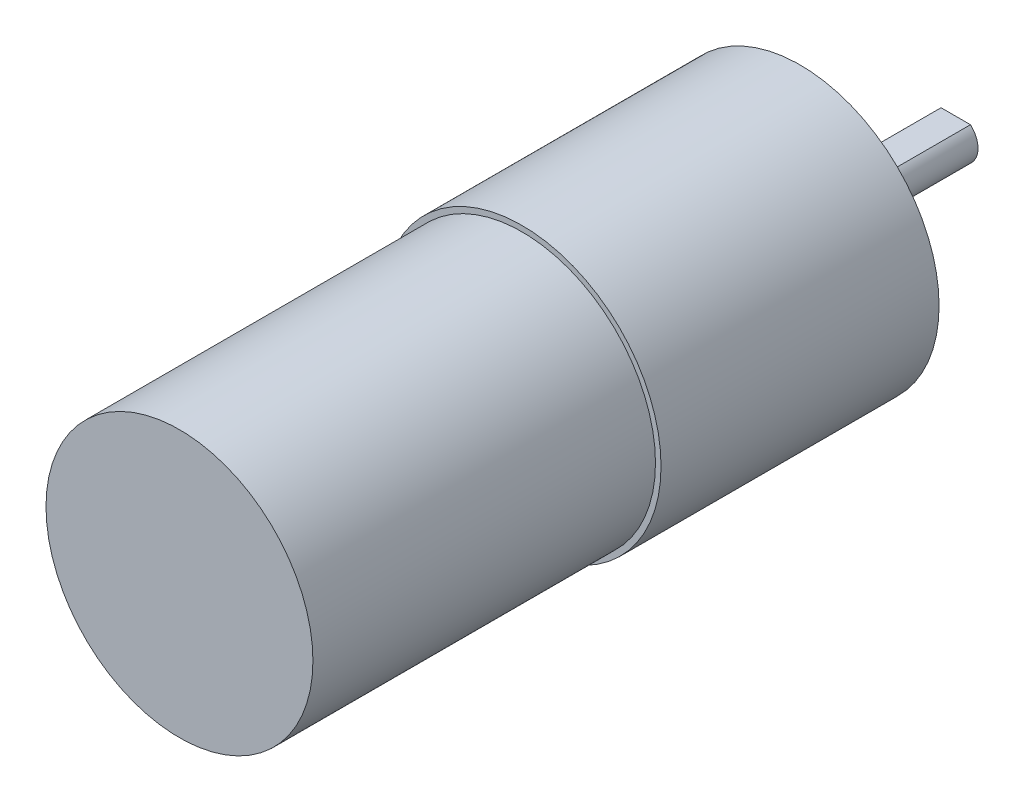
ISO-10303-21;
HEADER;
FILE_DESCRIPTION(('STEP AP214'),'2;1');
FILE_NAME('part.step','',(''),(''),'','','');
FILE_SCHEMA(('AUTOMOTIVE_DESIGN { 1 0 10303 214 1 1 1 1 }'));
ENDSEC;
DATA;
#1=APPLICATION_CONTEXT('core data for automotive mechanical design processes');
#2=APPLICATION_PROTOCOL_DEFINITION('international standard','automotive_design',2000,#1);
#3=PRODUCT_CONTEXT('',#1,'mechanical');
#4=PRODUCT('Part','Part','',(#3));
#5=PRODUCT_RELATED_PRODUCT_CATEGORY('part','',(#4));
#6=PRODUCT_DEFINITION_FORMATION('','',#4);
#7=PRODUCT_DEFINITION_CONTEXT('part definition',#1,'design');
#8=PRODUCT_DEFINITION('design','',#6,#7);
#9=PRODUCT_DEFINITION_SHAPE('','',#8);
#10=(LENGTH_UNIT() NAMED_UNIT(*) SI_UNIT(.MILLI.,.METRE.));
#11=(NAMED_UNIT(*) PLANE_ANGLE_UNIT() SI_UNIT($,.RADIAN.));
#12=(NAMED_UNIT(*) SI_UNIT($,.STERADIAN.) SOLID_ANGLE_UNIT());
#13=UNCERTAINTY_MEASURE_WITH_UNIT(LENGTH_MEASURE(1.E-05),#10,'distance_accuracy_value','');
#14=(GEOMETRIC_REPRESENTATION_CONTEXT(3) GLOBAL_UNCERTAINTY_ASSIGNED_CONTEXT((#13)) GLOBAL_UNIT_ASSIGNED_CONTEXT((#10,
#11,#12)) REPRESENTATION_CONTEXT('',''));
#15=CARTESIAN_POINT('',(0.,0.,0.));
#16=DIRECTION('',(0.,0.,1.));
#17=DIRECTION('',(1.,0.,0.));
#18=AXIS2_PLACEMENT_3D('',#15,#16,#17);
#19=CARTESIAN_POINT('',(0.,0.,25.));
#20=DIRECTION('',(0.,0.,-1.));
#21=DIRECTION('',(-1.,0.,0.));
#22=AXIS2_PLACEMENT_3D('',#19,#20,#21);
#23=CYLINDRICAL_SURFACE('',#22,12.5);
#24=CARTESIAN_POINT('',(0.,0.,25.));
#25=DIRECTION('',(0.,0.,1.));
#26=DIRECTION('',(1.,0.,0.));
#27=AXIS2_PLACEMENT_3D('',#24,#25,#26);
#28=CIRCLE('',#27,12.5);
#29=CARTESIAN_POINT('',(12.5,0.,25.));
#30=VERTEX_POINT('',#29);
#31=EDGE_CURVE('E91',#30,#30,#28,.T.);
#32=ORIENTED_EDGE('',*,*,#31,.F.);
#33=EDGE_LOOP('',(#32));
#34=FACE_BOUND('',#33,.T.);
#35=CARTESIAN_POINT('',(0.,0.,0.));
#36=DIRECTION('',(0.,0.,1.));
#37=DIRECTION('',(1.,0.,0.));
#38=AXIS2_PLACEMENT_3D('',#35,#36,#37);
#39=CIRCLE('',#38,12.5);
#40=CARTESIAN_POINT('',(12.5,0.,0.));
#41=VERTEX_POINT('',#40);
#42=EDGE_CURVE('E44',#41,#41,#39,.T.);
#43=ORIENTED_EDGE('',*,*,#42,.T.);
#44=EDGE_LOOP('',(#43));
#45=FACE_BOUND('',#44,.T.);
#46=ADVANCED_FACE('F41',(#34,#45),#23,.T.);
#47=CARTESIAN_POINT('',(0.,0.,25.));
#48=DIRECTION('',(0.,0.,1.));
#49=DIRECTION('',(1.,0.,0.));
#50=AXIS2_PLACEMENT_3D('',#47,#48,#49);
#51=PLANE('',#50);
#52=CARTESIAN_POINT('',(0.,0.,25.));
#53=DIRECTION('',(0.,0.,1.));
#54=DIRECTION('',(1.,0.,0.));
#55=AXIS2_PLACEMENT_3D('',#52,#53,#54);
#56=CIRCLE('',#55,12.);
#57=CARTESIAN_POINT('',(12.,0.,25.));
#58=VERTEX_POINT('',#57);
#59=EDGE_CURVE('E11',#58,#58,#56,.T.);
#60=ORIENTED_EDGE('',*,*,#59,.F.);
#61=EDGE_LOOP('',(#60));
#62=FACE_BOUND('',#61,.T.);
#63=ORIENTED_EDGE('',*,*,#31,.T.);
#64=EDGE_LOOP('',(#63));
#65=FACE_BOUND('',#64,.T.);
#66=ADVANCED_FACE('F102',(#62,#65),#51,.T.);
#67=CARTESIAN_POINT('',(0.,0.,0.));
#68=DIRECTION('',(0.,0.,1.));
#69=DIRECTION('',(1.,0.,0.));
#70=AXIS2_PLACEMENT_3D('',#67,#68,#69);
#71=PLANE('',#70);
#72=CARTESIAN_POINT('',(0.,0.,0.));
#73=DIRECTION('',(0.,0.,-1.));
#74=DIRECTION('',(-1.,0.,0.));
#75=AXIS2_PLACEMENT_3D('',#72,#73,#74);
#76=CIRCLE('',#75,3.);
#77=CARTESIAN_POINT('',(-3.,0.,0.));
#78=VERTEX_POINT('',#77);
#79=EDGE_CURVE('E88',#78,#78,#76,.T.);
#80=ORIENTED_EDGE('',*,*,#79,.F.);
#81=EDGE_LOOP('',(#80));
#82=FACE_BOUND('',#81,.T.);
#83=ORIENTED_EDGE('',*,*,#42,.F.);
#84=EDGE_LOOP('',(#83));
#85=FACE_BOUND('',#84,.T.);
#86=ADVANCED_FACE('F99',(#82,#85),#71,.F.);
#87=CARTESIAN_POINT('',(0.,0.,-2.));
#88=DIRECTION('',(0.,0.,1.));
#89=DIRECTION('',(1.,0.,0.));
#90=AXIS2_PLACEMENT_3D('',#87,#88,#89);
#91=CYLINDRICAL_SURFACE('',#90,3.);
#92=CARTESIAN_POINT('',(0.,0.,-2.));
#93=DIRECTION('',(0.,0.,-1.));
#94=DIRECTION('',(-1.,0.,0.));
#95=AXIS2_PLACEMENT_3D('',#92,#93,#94);
#96=CIRCLE('',#95,3.);
#97=CARTESIAN_POINT('',(-3.,0.,-2.));
#98=VERTEX_POINT('',#97);
#99=EDGE_CURVE('E82',#98,#98,#96,.T.);
#100=ORIENTED_EDGE('',*,*,#99,.F.);
#101=EDGE_LOOP('',(#100));
#102=FACE_BOUND('',#101,.T.);
#103=ORIENTED_EDGE('',*,*,#79,.T.);
#104=EDGE_LOOP('',(#103));
#105=FACE_BOUND('',#104,.T.);
#106=ADVANCED_FACE('F101',(#102,#105),#91,.T.);
#107=CARTESIAN_POINT('',(0.,0.,-2.));
#108=DIRECTION('',(0.,0.,-1.));
#109=DIRECTION('',(-1.,0.,0.));
#110=AXIS2_PLACEMENT_3D('',#107,#108,#109);
#111=PLANE('',#110);
#112=CARTESIAN_POINT('',(0.,0.,-2.));
#113=DIRECTION('',(0.,0.,-1.));
#114=DIRECTION('',(-1.,0.,0.));
#115=AXIS2_PLACEMENT_3D('',#112,#113,#114);
#116=CIRCLE('',#115,2.);
#117=CARTESIAN_POINT('',(1.3228756555323,1.5,-2.));
#118=VERTEX_POINT('',#117);
#119=CARTESIAN_POINT('',(-1.3228756555323,1.5,-2.));
#120=VERTEX_POINT('',#119);
#121=EDGE_CURVE('E49',#118,#120,#116,.T.);
#122=ORIENTED_EDGE('',*,*,#121,.F.);
#123=DIRECTION('',(-1.,0.,0.));
#124=VECTOR('',#123,1.);
#125=CARTESIAN_POINT('',(1.3228756555323,1.5,-2.));
#126=LINE('',#125,#124);
#127=EDGE_CURVE('E72',#118,#120,#126,.T.);
#128=ORIENTED_EDGE('',*,*,#127,.T.);
#129=EDGE_LOOP('',(#122,#128));
#130=FACE_BOUND('',#129,.T.);
#131=ORIENTED_EDGE('',*,*,#99,.T.);
#132=EDGE_LOOP('',(#131));
#133=FACE_BOUND('',#132,.T.);
#134=ADVANCED_FACE('F108',(#130,#133),#111,.T.);
#135=CARTESIAN_POINT('',(0.,0.,-14.));
#136=DIRECTION('',(0.,0.,1.));
#137=DIRECTION('',(1.,0.,0.));
#138=AXIS2_PLACEMENT_3D('',#135,#136,#137);
#139=CYLINDRICAL_SURFACE('',#138,2.);
#140=CARTESIAN_POINT('',(0.,0.,-14.));
#141=DIRECTION('',(0.,0.,-1.));
#142=DIRECTION('',(-1.,0.,0.));
#143=AXIS2_PLACEMENT_3D('',#140,#141,#142);
#144=CIRCLE('',#143,2.);
#145=CARTESIAN_POINT('',(1.3228756555323,1.5,-14.));
#146=VERTEX_POINT('',#145);
#147=CARTESIAN_POINT('',(-1.3228756555323,1.5,-14.));
#148=VERTEX_POINT('',#147);
#149=EDGE_CURVE('E78',#146,#148,#144,.T.);
#150=ORIENTED_EDGE('',*,*,#149,.F.);
#151=DIRECTION('',(0.,0.,-1.));
#152=VECTOR('',#151,1.);
#153=CARTESIAN_POINT('',(1.3228756555323,1.5,-2.));
#154=LINE('',#153,#152);
#155=EDGE_CURVE('E57',#118,#146,#154,.T.);
#156=ORIENTED_EDGE('',*,*,#155,.F.);
#157=ORIENTED_EDGE('',*,*,#121,.T.);
#158=DIRECTION('',(0.,0.,-1.));
#159=VECTOR('',#158,1.);
#160=CARTESIAN_POINT('',(-1.3228756555323,1.5,-2.));
#161=LINE('',#160,#159);
#162=EDGE_CURVE('E63',#120,#148,#161,.T.);
#163=ORIENTED_EDGE('',*,*,#162,.T.);
#164=EDGE_LOOP('',(#150,#156,#157,#163));
#165=FACE_BOUND('',#164,.T.);
#166=ADVANCED_FACE('F77',(#165),#139,.T.);
#167=CARTESIAN_POINT('',(0.,0.,-14.));
#168=DIRECTION('',(0.,0.,-1.));
#169=DIRECTION('',(-1.,0.,0.));
#170=AXIS2_PLACEMENT_3D('',#167,#168,#169);
#171=PLANE('',#170);
#172=DIRECTION('',(-1.,0.,0.));
#173=VECTOR('',#172,1.);
#174=CARTESIAN_POINT('',(1.3228756555323,1.5,-14.));
#175=LINE('',#174,#173);
#176=EDGE_CURVE('E67',#146,#148,#175,.T.);
#177=ORIENTED_EDGE('',*,*,#176,.F.);
#178=ORIENTED_EDGE('',*,*,#149,.T.);
#179=EDGE_LOOP('',(#177,#178));
#180=FACE_BOUND('',#179,.T.);
#181=ADVANCED_FACE('F81',(#180),#171,.T.);
#182=CARTESIAN_POINT('',(1.3228756555323,1.5,-2.));
#183=DIRECTION('',(0.,-1.,0.));
#184=DIRECTION('',(0.,0.,-1.));
#185=AXIS2_PLACEMENT_3D('',#182,#183,#184);
#186=PLANE('',#185);
#187=ORIENTED_EDGE('',*,*,#176,.T.);
#188=ORIENTED_EDGE('',*,*,#162,.F.);
#189=ORIENTED_EDGE('',*,*,#127,.F.);
#190=ORIENTED_EDGE('',*,*,#155,.T.);
#191=EDGE_LOOP('',(#187,#188,#189,#190));
#192=FACE_BOUND('',#191,.T.);
#193=ADVANCED_FACE('F68',(#192),#186,.F.);
#194=CARTESIAN_POINT('',(0.,0.,55.8));
#195=DIRECTION('',(0.,0.,-1.));
#196=DIRECTION('',(-1.,0.,0.));
#197=AXIS2_PLACEMENT_3D('',#194,#195,#196);
#198=CYLINDRICAL_SURFACE('',#197,12.);
#199=CARTESIAN_POINT('',(0.,0.,55.8));
#200=DIRECTION('',(0.,0.,1.));
#201=DIRECTION('',(1.,0.,0.));
#202=AXIS2_PLACEMENT_3D('',#199,#200,#201);
#203=CIRCLE('',#202,12.);
#204=CARTESIAN_POINT('',(12.,0.,55.8));
#205=VERTEX_POINT('',#204);
#206=EDGE_CURVE('E73',#205,#205,#203,.T.);
#207=ORIENTED_EDGE('',*,*,#206,.F.);
#208=EDGE_LOOP('',(#207));
#209=FACE_BOUND('',#208,.T.);
#210=ORIENTED_EDGE('',*,*,#59,.T.);
#211=EDGE_LOOP('',(#210));
#212=FACE_BOUND('',#211,.T.);
#213=ADVANCED_FACE('F170',(#209,#212),#198,.T.);
#214=CARTESIAN_POINT('',(0.,0.,55.8));
#215=DIRECTION('',(0.,0.,1.));
#216=DIRECTION('',(1.,0.,0.));
#217=AXIS2_PLACEMENT_3D('',#214,#215,#216);
#218=PLANE('',#217);
#219=ORIENTED_EDGE('',*,*,#206,.T.);
#220=EDGE_LOOP('',(#219));
#221=FACE_BOUND('',#220,.T.);
#222=ADVANCED_FACE('F180',(#221),#218,.T.);
#223=CLOSED_SHELL('',(#46,#66,#86,#106,#134,#166,#181,#193,#213,#222));
#224=MANIFOLD_SOLID_BREP('B2',#223);
#225=ADVANCED_BREP_SHAPE_REPRESENTATION('',(#18,#224),#14);
#226=SHAPE_DEFINITION_REPRESENTATION(#9,#225);
ENDSEC;
END-ISO-10303-21;
